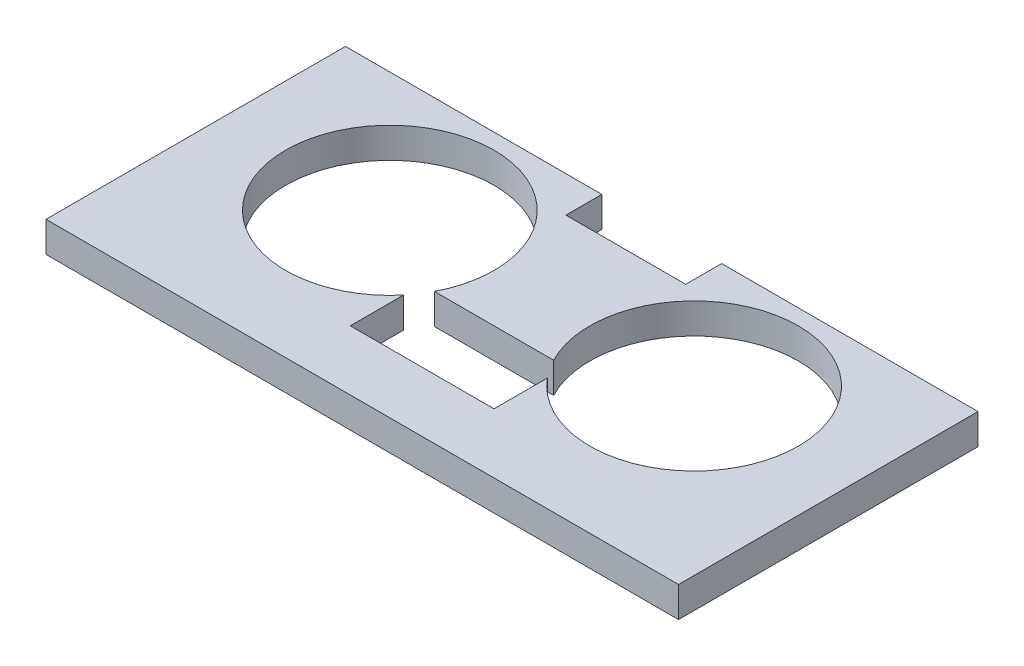
ISO-10303-21;
HEADER;
FILE_DESCRIPTION(('STEP AP214'),'2;1');
FILE_NAME('part.step','',(''),(''),'','','');
FILE_SCHEMA(('AUTOMOTIVE_DESIGN { 1 0 10303 214 1 1 1 1 }'));
ENDSEC;
DATA;
#1=APPLICATION_CONTEXT('core data for automotive mechanical design processes');
#2=APPLICATION_PROTOCOL_DEFINITION('international standard','automotive_design',2000,#1);
#3=PRODUCT_CONTEXT('',#1,'mechanical');
#4=PRODUCT('Part','Part','',(#3));
#5=PRODUCT_RELATED_PRODUCT_CATEGORY('part','',(#4));
#6=PRODUCT_DEFINITION_FORMATION('','',#4);
#7=PRODUCT_DEFINITION_CONTEXT('part definition',#1,'design');
#8=PRODUCT_DEFINITION('design','',#6,#7);
#9=PRODUCT_DEFINITION_SHAPE('','',#8);
#10=(LENGTH_UNIT() NAMED_UNIT(*) SI_UNIT(.MILLI.,.METRE.));
#11=(NAMED_UNIT(*) PLANE_ANGLE_UNIT() SI_UNIT($,.RADIAN.));
#12=(NAMED_UNIT(*) SI_UNIT($,.STERADIAN.) SOLID_ANGLE_UNIT());
#13=UNCERTAINTY_MEASURE_WITH_UNIT(LENGTH_MEASURE(1.E-05),#10,'distance_accuracy_value','');
#14=(GEOMETRIC_REPRESENTATION_CONTEXT(3) GLOBAL_UNCERTAINTY_ASSIGNED_CONTEXT((#13)) GLOBAL_UNIT_ASSIGNED_CONTEXT((#10,
#11,#12)) REPRESENTATION_CONTEXT('',''));
#15=CARTESIAN_POINT('',(0.,0.,0.));
#16=DIRECTION('',(0.,0.,1.));
#17=DIRECTION('',(1.,0.,0.));
#18=AXIS2_PLACEMENT_3D('',#15,#16,#17);
#19=CARTESIAN_POINT('',(-20.8,2.54,0.));
#20=DIRECTION('',(1.,0.,0.));
#21=DIRECTION('',(0.,0.,-1.));
#22=AXIS2_PLACEMENT_3D('',#19,#20,#21);
#23=PLANE('',#22);
#24=DIRECTION('',(0.,0.,1.));
#25=VECTOR('',#24,1.);
#26=CARTESIAN_POINT('',(-20.8,0.,0.));
#27=LINE('',#26,#25);
#28=CARTESIAN_POINT('',(-20.8,0.,-11.5));
#29=VERTEX_POINT('',#28);
#30=CARTESIAN_POINT('',(-20.8,0.,13.5));
#31=VERTEX_POINT('',#30);
#32=EDGE_CURVE('E209',#29,#31,#27,.T.);
#33=ORIENTED_EDGE('',*,*,#32,.T.);
#34=DIRECTION('',(0.,-1.,0.));
#35=VECTOR('',#34,1.);
#36=CARTESIAN_POINT('',(-20.8,2.54,13.5));
#37=LINE('',#36,#35);
#38=CARTESIAN_POINT('',(-20.8,2.54,13.5));
#39=VERTEX_POINT('',#38);
#40=EDGE_CURVE('E11',#39,#31,#37,.T.);
#41=ORIENTED_EDGE('',*,*,#40,.F.);
#42=DIRECTION('',(0.,0.,1.));
#43=VECTOR('',#42,1.);
#44=CARTESIAN_POINT('',(-20.8,2.54,0.));
#45=LINE('',#44,#43);
#46=CARTESIAN_POINT('',(-20.8,2.54,-11.5));
#47=VERTEX_POINT('',#46);
#48=EDGE_CURVE('E308',#47,#39,#45,.T.);
#49=ORIENTED_EDGE('',*,*,#48,.F.);
#50=DIRECTION('',(0.,-1.,0.));
#51=VECTOR('',#50,1.);
#52=CARTESIAN_POINT('',(-20.8,2.54,-11.5));
#53=LINE('',#52,#51);
#54=EDGE_CURVE('E61',#47,#29,#53,.T.);
#55=ORIENTED_EDGE('',*,*,#54,.T.);
#56=EDGE_LOOP('',(#33,#41,#49,#55));
#57=FACE_BOUND('',#56,.T.);
#58=ADVANCED_FACE('F41',(#57),#23,.F.);
#59=CARTESIAN_POINT('',(0.,2.54,13.5));
#60=DIRECTION('',(0.,0.,-1.));
#61=DIRECTION('',(-1.,0.,0.));
#62=AXIS2_PLACEMENT_3D('',#59,#60,#61);
#63=PLANE('',#62);
#64=DIRECTION('',(1.,0.,0.));
#65=VECTOR('',#64,1.);
#66=CARTESIAN_POINT('',(0.,0.,13.5));
#67=LINE('',#66,#65);
#68=CARTESIAN_POINT('',(32.,0.,13.5));
#69=VERTEX_POINT('',#68);
#70=EDGE_CURVE('E212',#31,#69,#67,.T.);
#71=ORIENTED_EDGE('',*,*,#70,.T.);
#72=DIRECTION('',(0.,-1.,0.));
#73=VECTOR('',#72,1.);
#74=CARTESIAN_POINT('',(32.,2.54,13.5));
#75=LINE('',#74,#73);
#76=CARTESIAN_POINT('',(32.,2.54,13.5));
#77=VERTEX_POINT('',#76);
#78=EDGE_CURVE('E52',#77,#69,#75,.T.);
#79=ORIENTED_EDGE('',*,*,#78,.F.);
#80=DIRECTION('',(1.,0.,0.));
#81=VECTOR('',#80,1.);
#82=CARTESIAN_POINT('',(0.,2.54,13.5));
#83=LINE('',#82,#81);
#84=EDGE_CURVE('E311',#39,#77,#83,.T.);
#85=ORIENTED_EDGE('',*,*,#84,.F.);
#86=ORIENTED_EDGE('',*,*,#40,.T.);
#87=EDGE_LOOP('',(#71,#79,#85,#86));
#88=FACE_BOUND('',#87,.T.);
#89=ADVANCED_FACE('F342',(#88),#63,.F.);
#90=CARTESIAN_POINT('',(32.,2.54,0.));
#91=DIRECTION('',(1.,0.,0.));
#92=DIRECTION('',(0.,0.,-1.));
#93=AXIS2_PLACEMENT_3D('',#90,#91,#92);
#94=PLANE('',#93);
#95=DIRECTION('',(0.,0.,1.));
#96=VECTOR('',#95,1.);
#97=CARTESIAN_POINT('',(32.,0.,0.));
#98=LINE('',#97,#96);
#99=CARTESIAN_POINT('',(32.,0.,-11.5));
#100=VERTEX_POINT('',#99);
#101=EDGE_CURVE('E216',#100,#69,#98,.T.);
#102=ORIENTED_EDGE('',*,*,#101,.F.);
#103=DIRECTION('',(0.,-1.,0.));
#104=VECTOR('',#103,1.);
#105=CARTESIAN_POINT('',(32.,2.54,-11.5));
#106=LINE('',#105,#104);
#107=CARTESIAN_POINT('',(32.,2.54,-11.5));
#108=VERTEX_POINT('',#107);
#109=EDGE_CURVE('E243',#108,#100,#106,.T.);
#110=ORIENTED_EDGE('',*,*,#109,.F.);
#111=DIRECTION('',(0.,0.,1.));
#112=VECTOR('',#111,1.);
#113=CARTESIAN_POINT('',(32.,2.54,0.));
#114=LINE('',#113,#112);
#115=EDGE_CURVE('E314',#108,#77,#114,.T.);
#116=ORIENTED_EDGE('',*,*,#115,.T.);
#117=ORIENTED_EDGE('',*,*,#78,.T.);
#118=EDGE_LOOP('',(#102,#110,#116,#117));
#119=FACE_BOUND('',#118,.T.);
#120=ADVANCED_FACE('F327',(#119),#94,.T.);
#121=CARTESIAN_POINT('',(0.,2.54,-11.5));
#122=DIRECTION('',(0.,0.,-1.));
#123=DIRECTION('',(-1.,0.,0.));
#124=AXIS2_PLACEMENT_3D('',#121,#122,#123);
#125=PLANE('',#124);
#126=DIRECTION('',(1.,0.,0.));
#127=VECTOR('',#126,1.);
#128=CARTESIAN_POINT('',(0.,0.,-11.5));
#129=LINE('',#128,#127);
#130=CARTESIAN_POINT('',(10.6,0.,-11.5));
#131=VERTEX_POINT('',#130);
#132=EDGE_CURVE('E220',#131,#100,#129,.T.);
#133=ORIENTED_EDGE('',*,*,#132,.F.);
#134=DIRECTION('',(0.,-1.,0.));
#135=VECTOR('',#134,1.);
#136=CARTESIAN_POINT('',(10.6,2.54,-11.5));
#137=LINE('',#136,#135);
#138=CARTESIAN_POINT('',(10.6,2.54,-11.5));
#139=VERTEX_POINT('',#138);
#140=EDGE_CURVE('E240',#139,#131,#137,.T.);
#141=ORIENTED_EDGE('',*,*,#140,.F.);
#142=DIRECTION('',(1.,0.,0.));
#143=VECTOR('',#142,1.);
#144=CARTESIAN_POINT('',(0.,2.54,-11.5));
#145=LINE('',#144,#143);
#146=EDGE_CURVE('E182',#139,#108,#145,.T.);
#147=ORIENTED_EDGE('',*,*,#146,.T.);
#148=ORIENTED_EDGE('',*,*,#109,.T.);
#149=EDGE_LOOP('',(#133,#141,#147,#148));
#150=FACE_BOUND('',#149,.T.);
#151=ADVANCED_FACE('F322',(#150),#125,.T.);
#152=CARTESIAN_POINT('',(10.6,2.54,0.));
#153=DIRECTION('',(1.,0.,0.));
#154=DIRECTION('',(0.,0.,-1.));
#155=AXIS2_PLACEMENT_3D('',#152,#153,#154);
#156=PLANE('',#155);
#157=DIRECTION('',(0.,0.,1.));
#158=VECTOR('',#157,1.);
#159=CARTESIAN_POINT('',(10.6,0.,0.));
#160=LINE('',#159,#158);
#161=CARTESIAN_POINT('',(10.6,0.,-8.5));
#162=VERTEX_POINT('',#161);
#163=EDGE_CURVE('E224',#131,#162,#160,.T.);
#164=ORIENTED_EDGE('',*,*,#163,.T.);
#165=DIRECTION('',(0.,-1.,0.));
#166=VECTOR('',#165,1.);
#167=CARTESIAN_POINT('',(10.6,2.54,-8.5));
#168=LINE('',#167,#166);
#169=CARTESIAN_POINT('',(10.6,2.54,-8.5));
#170=VERTEX_POINT('',#169);
#171=EDGE_CURVE('E161',#170,#162,#168,.T.);
#172=ORIENTED_EDGE('',*,*,#171,.F.);
#173=DIRECTION('',(0.,0.,1.));
#174=VECTOR('',#173,1.);
#175=CARTESIAN_POINT('',(10.6,2.54,0.));
#176=LINE('',#175,#174);
#177=EDGE_CURVE('E171',#139,#170,#176,.T.);
#178=ORIENTED_EDGE('',*,*,#177,.F.);
#179=ORIENTED_EDGE('',*,*,#140,.T.);
#180=EDGE_LOOP('',(#164,#172,#178,#179));
#181=FACE_BOUND('',#180,.T.);
#182=ADVANCED_FACE('F330',(#181),#156,.F.);
#183=CARTESIAN_POINT('',(0.,2.54,-8.5));
#184=DIRECTION('',(0.,0.,-1.));
#185=DIRECTION('',(-1.,0.,0.));
#186=AXIS2_PLACEMENT_3D('',#183,#184,#185);
#187=PLANE('',#186);
#188=DIRECTION('',(1.,0.,0.));
#189=VECTOR('',#188,1.);
#190=CARTESIAN_POINT('',(0.,0.,-8.5));
#191=LINE('',#190,#189);
#192=CARTESIAN_POINT('',(0.600000000000009,0.,-8.5));
#193=VERTEX_POINT('',#192);
#194=EDGE_CURVE('E156',#193,#162,#191,.T.);
#195=ORIENTED_EDGE('',*,*,#194,.F.);
#196=DIRECTION('',(0.,-1.,0.));
#197=VECTOR('',#196,1.);
#198=CARTESIAN_POINT('',(0.600000000000009,2.54,-8.5));
#199=LINE('',#198,#197);
#200=CARTESIAN_POINT('',(0.600000000000009,2.54,-8.5));
#201=VERTEX_POINT('',#200);
#202=EDGE_CURVE('E151',#201,#193,#199,.T.);
#203=ORIENTED_EDGE('',*,*,#202,.F.);
#204=DIRECTION('',(1.,0.,0.));
#205=VECTOR('',#204,1.);
#206=CARTESIAN_POINT('',(0.,2.54,-8.5));
#207=LINE('',#206,#205);
#208=EDGE_CURVE('E154',#201,#170,#207,.T.);
#209=ORIENTED_EDGE('',*,*,#208,.T.);
#210=ORIENTED_EDGE('',*,*,#171,.T.);
#211=EDGE_LOOP('',(#195,#203,#209,#210));
#212=FACE_BOUND('',#211,.T.);
#213=ADVANCED_FACE('F153',(#212),#187,.T.);
#214=CARTESIAN_POINT('',(0.60000000000001,2.54,0.));
#215=DIRECTION('',(1.,0.,0.));
#216=DIRECTION('',(0.,0.,-1.));
#217=AXIS2_PLACEMENT_3D('',#214,#215,#216);
#218=PLANE('',#217);
#219=DIRECTION('',(0.,0.,1.));
#220=VECTOR('',#219,1.);
#221=CARTESIAN_POINT('',(0.60000000000001,0.,0.));
#222=LINE('',#221,#220);
#223=CARTESIAN_POINT('',(0.600000000000009,0.,-11.5));
#224=VERTEX_POINT('',#223);
#225=EDGE_CURVE('E231',#224,#193,#222,.T.);
#226=ORIENTED_EDGE('',*,*,#225,.F.);
#227=DIRECTION('',(0.,-1.,0.));
#228=VECTOR('',#227,1.);
#229=CARTESIAN_POINT('',(0.600000000000009,2.54,-11.5));
#230=LINE('',#229,#228);
#231=CARTESIAN_POINT('',(0.600000000000009,2.54,-11.5));
#232=VERTEX_POINT('',#231);
#233=EDGE_CURVE('E105',#232,#224,#230,.T.);
#234=ORIENTED_EDGE('',*,*,#233,.F.);
#235=DIRECTION('',(0.,0.,1.));
#236=VECTOR('',#235,1.);
#237=CARTESIAN_POINT('',(0.60000000000001,2.54,0.));
#238=LINE('',#237,#236);
#239=EDGE_CURVE('E168',#232,#201,#238,.T.);
#240=ORIENTED_EDGE('',*,*,#239,.T.);
#241=ORIENTED_EDGE('',*,*,#202,.T.);
#242=EDGE_LOOP('',(#226,#234,#240,#241));
#243=FACE_BOUND('',#242,.T.);
#244=ADVANCED_FACE('F175',(#243),#218,.T.);
#245=CARTESIAN_POINT('',(0.,2.54,8.5));
#246=DIRECTION('',(0.,0.,-1.));
#247=DIRECTION('',(-1.,0.,0.));
#248=AXIS2_PLACEMENT_3D('',#245,#246,#247);
#249=PLANE('',#248);
#250=DIRECTION('',(1.,0.,0.));
#251=VECTOR('',#250,1.);
#252=CARTESIAN_POINT('',(0.,0.,8.5));
#253=LINE('',#252,#251);
#254=CARTESIAN_POINT('',(-0.399999999999987,0.,8.5));
#255=VERTEX_POINT('',#254);
#256=CARTESIAN_POINT('',(11.6,0.,8.5));
#257=VERTEX_POINT('',#256);
#258=EDGE_CURVE('E185',#255,#257,#253,.T.);
#259=ORIENTED_EDGE('',*,*,#258,.F.);
#260=DIRECTION('',(0.,-1.,0.));
#261=VECTOR('',#260,1.);
#262=CARTESIAN_POINT('',(-0.399999999999987,2.54,8.5));
#263=LINE('',#262,#261);
#264=CARTESIAN_POINT('',(-0.399999999999987,2.54,8.5));
#265=VERTEX_POINT('',#264);
#266=EDGE_CURVE('E45',#265,#255,#263,.T.);
#267=ORIENTED_EDGE('',*,*,#266,.F.);
#268=DIRECTION('',(1.,0.,0.));
#269=VECTOR('',#268,1.);
#270=CARTESIAN_POINT('',(0.,2.54,8.5));
#271=LINE('',#270,#269);
#272=CARTESIAN_POINT('',(11.6,2.54,8.5));
#273=VERTEX_POINT('',#272);
#274=EDGE_CURVE('E275',#265,#273,#271,.T.);
#275=ORIENTED_EDGE('',*,*,#274,.T.);
#276=DIRECTION('',(0.,-1.,0.));
#277=VECTOR('',#276,1.);
#278=CARTESIAN_POINT('',(11.6,2.54,8.5));
#279=LINE('',#278,#277);
#280=EDGE_CURVE('E180',#273,#257,#279,.T.);
#281=ORIENTED_EDGE('',*,*,#280,.T.);
#282=EDGE_LOOP('',(#259,#267,#275,#281));
#283=FACE_BOUND('',#282,.T.);
#284=ADVANCED_FACE('F43',(#283),#249,.T.);
#285=CARTESIAN_POINT('',(-0.399999999999987,2.54,0.));
#286=DIRECTION('',(-1.,0.,0.));
#287=DIRECTION('',(0.,0.,1.));
#288=AXIS2_PLACEMENT_3D('',#285,#286,#287);
#289=PLANE('',#288);
#290=DIRECTION('',(0.,0.,-1.));
#291=VECTOR('',#290,1.);
#292=CARTESIAN_POINT('',(-0.399999999999987,0.,0.));
#293=LINE('',#292,#291);
#294=CARTESIAN_POINT('',(-0.399999999999987,0.,4.04977477020464));
#295=VERTEX_POINT('',#294);
#296=EDGE_CURVE('E189',#255,#295,#293,.T.);
#297=ORIENTED_EDGE('',*,*,#296,.T.);
#298=DIRECTION('',(0.,-1.,0.));
#299=VECTOR('',#298,1.);
#300=CARTESIAN_POINT('',(-0.399999999999987,2.54,4.04977477020464));
#301=LINE('',#300,#299);
#302=CARTESIAN_POINT('',(-0.399999999999987,2.54,4.04977477020464));
#303=VERTEX_POINT('',#302);
#304=EDGE_CURVE('E258',#303,#295,#301,.T.);
#305=ORIENTED_EDGE('',*,*,#304,.F.);
#306=DIRECTION('',(0.,0.,-1.));
#307=VECTOR('',#306,1.);
#308=CARTESIAN_POINT('',(-0.399999999999987,2.54,0.));
#309=LINE('',#308,#307);
#310=EDGE_CURVE('E268',#265,#303,#309,.T.);
#311=ORIENTED_EDGE('',*,*,#310,.F.);
#312=ORIENTED_EDGE('',*,*,#266,.T.);
#313=EDGE_LOOP('',(#297,#305,#311,#312));
#314=FACE_BOUND('',#313,.T.);
#315=ADVANCED_FACE('F267',(#314),#289,.F.);
#316=CARTESIAN_POINT('',(-7.09999999999999,2.54,-1.5));
#317=DIRECTION('',(0.,-1.,0.));
#318=DIRECTION('',(0.,0.,-1.));
#319=AXIS2_PLACEMENT_3D('',#316,#317,#318);
#320=CYLINDRICAL_SURFACE('',#319,8.7);
#321=CARTESIAN_POINT('',(-7.09999999999999,0.,-1.5));
#322=DIRECTION('',(0.,1.,0.));
#323=DIRECTION('',(0.,0.,1.));
#324=AXIS2_PLACEMENT_3D('',#321,#322,#323);
#325=CIRCLE('',#324,8.7);
#326=CARTESIAN_POINT('',(0.625930364687489,0.,2.5));
#327=VERTEX_POINT('',#326);
#328=EDGE_CURVE('E193',#327,#295,#325,.T.);
#329=ORIENTED_EDGE('',*,*,#328,.F.);
#330=DIRECTION('',(0.,-1.,0.));
#331=VECTOR('',#330,1.);
#332=CARTESIAN_POINT('',(0.625930364687489,2.54,2.5));
#333=LINE('',#332,#331);
#334=CARTESIAN_POINT('',(0.625930364687489,2.54,2.5));
#335=VERTEX_POINT('',#334);
#336=EDGE_CURVE('E256',#335,#327,#333,.T.);
#337=ORIENTED_EDGE('',*,*,#336,.F.);
#338=CARTESIAN_POINT('',(-7.09999999999999,2.54,-1.5));
#339=DIRECTION('',(0.,1.,0.));
#340=DIRECTION('',(0.,0.,1.));
#341=AXIS2_PLACEMENT_3D('',#338,#339,#340);
#342=CIRCLE('',#341,8.7);
#343=EDGE_CURVE('E294',#335,#303,#342,.T.);
#344=ORIENTED_EDGE('',*,*,#343,.T.);
#345=ORIENTED_EDGE('',*,*,#304,.T.);
#346=EDGE_LOOP('',(#329,#337,#344,#345));
#347=FACE_BOUND('',#346,.T.);
#348=ADVANCED_FACE('F293',(#347),#320,.F.);
#349=CARTESIAN_POINT('',(0.,2.54,2.5));
#350=DIRECTION('',(0.,0.,-1.));
#351=DIRECTION('',(-1.,0.,0.));
#352=AXIS2_PLACEMENT_3D('',#349,#350,#351);
#353=PLANE('',#352);
#354=DIRECTION('',(1.,0.,0.));
#355=VECTOR('',#354,1.);
#356=CARTESIAN_POINT('',(0.,0.,2.5));
#357=LINE('',#356,#355);
#358=CARTESIAN_POINT('',(10.5740696353125,0.,2.5));
#359=VERTEX_POINT('',#358);
#360=EDGE_CURVE('E197',#327,#359,#357,.T.);
#361=ORIENTED_EDGE('',*,*,#360,.T.);
#362=DIRECTION('',(0.,-1.,0.));
#363=VECTOR('',#362,1.);
#364=CARTESIAN_POINT('',(10.5740696353125,2.54,2.5));
#365=LINE('',#364,#363);
#366=CARTESIAN_POINT('',(10.5740696353125,2.54,2.5));
#367=VERTEX_POINT('',#366);
#368=EDGE_CURVE('E253',#367,#359,#365,.T.);
#369=ORIENTED_EDGE('',*,*,#368,.F.);
#370=DIRECTION('',(1.,0.,0.));
#371=VECTOR('',#370,1.);
#372=CARTESIAN_POINT('',(0.,2.54,2.5));
#373=LINE('',#372,#371);
#374=EDGE_CURVE('E291',#335,#367,#373,.T.);
#375=ORIENTED_EDGE('',*,*,#374,.F.);
#376=ORIENTED_EDGE('',*,*,#336,.T.);
#377=EDGE_LOOP('',(#361,#369,#375,#376));
#378=FACE_BOUND('',#377,.T.);
#379=ADVANCED_FACE('F290',(#378),#353,.F.);
#380=CARTESIAN_POINT('',(18.3,2.54,-1.5));
#381=DIRECTION('',(0.,-1.,0.));
#382=DIRECTION('',(0.,0.,-1.));
#383=AXIS2_PLACEMENT_3D('',#380,#381,#382);
#384=CYLINDRICAL_SURFACE('',#383,8.7);
#385=CARTESIAN_POINT('',(18.3,0.,-1.5));
#386=DIRECTION('',(0.,1.,0.));
#387=DIRECTION('',(0.,0.,1.));
#388=AXIS2_PLACEMENT_3D('',#385,#386,#387);
#389=CIRCLE('',#388,8.7);
#390=CARTESIAN_POINT('',(11.6,0.,4.04977477020464));
#391=VERTEX_POINT('',#390);
#392=EDGE_CURVE('E201',#391,#359,#389,.T.);
#393=ORIENTED_EDGE('',*,*,#392,.F.);
#394=DIRECTION('',(0.,-1.,0.));
#395=VECTOR('',#394,1.);
#396=CARTESIAN_POINT('',(11.6,2.54,4.04977477020464));
#397=LINE('',#396,#395);
#398=CARTESIAN_POINT('',(11.6,2.54,4.04977477020464));
#399=VERTEX_POINT('',#398);
#400=EDGE_CURVE('E250',#399,#391,#397,.T.);
#401=ORIENTED_EDGE('',*,*,#400,.F.);
#402=CARTESIAN_POINT('',(18.3,2.54,-1.5));
#403=DIRECTION('',(0.,1.,0.));
#404=DIRECTION('',(0.,0.,1.));
#405=AXIS2_PLACEMENT_3D('',#402,#403,#404);
#406=CIRCLE('',#405,8.7);
#407=EDGE_CURVE('E287',#399,#367,#406,.T.);
#408=ORIENTED_EDGE('',*,*,#407,.T.);
#409=ORIENTED_EDGE('',*,*,#368,.T.);
#410=EDGE_LOOP('',(#393,#401,#408,#409));
#411=FACE_BOUND('',#410,.T.);
#412=ADVANCED_FACE('F283',(#411),#384,.F.);
#413=CARTESIAN_POINT('',(11.6,2.54,0.));
#414=DIRECTION('',(-1.,0.,0.));
#415=DIRECTION('',(0.,0.,1.));
#416=AXIS2_PLACEMENT_3D('',#413,#414,#415);
#417=PLANE('',#416);
#418=DIRECTION('',(0.,0.,-1.));
#419=VECTOR('',#418,1.);
#420=CARTESIAN_POINT('',(11.6,0.,0.));
#421=LINE('',#420,#419);
#422=EDGE_CURVE('E205',#257,#391,#421,.T.);
#423=ORIENTED_EDGE('',*,*,#422,.F.);
#424=ORIENTED_EDGE('',*,*,#280,.F.);
#425=DIRECTION('',(0.,0.,-1.));
#426=VECTOR('',#425,1.);
#427=CARTESIAN_POINT('',(11.6,2.54,0.));
#428=LINE('',#427,#426);
#429=EDGE_CURVE('E280',#273,#399,#428,.T.);
#430=ORIENTED_EDGE('',*,*,#429,.T.);
#431=ORIENTED_EDGE('',*,*,#400,.T.);
#432=EDGE_LOOP('',(#423,#424,#430,#431));
#433=FACE_BOUND('',#432,.T.);
#434=ADVANCED_FACE('F279',(#433),#417,.T.);
#435=EDGE_CURVE('E225',#29,#224,#129,.T.);
#436=ORIENTED_EDGE('',*,*,#435,.F.);
#437=ORIENTED_EDGE('',*,*,#54,.F.);
#438=EDGE_CURVE('E177',#47,#232,#145,.T.);
#439=ORIENTED_EDGE('',*,*,#438,.T.);
#440=ORIENTED_EDGE('',*,*,#233,.T.);
#441=EDGE_LOOP('',(#436,#437,#439,#440));
#442=FACE_BOUND('',#441,.T.);
#443=ADVANCED_FACE('F339',(#442),#125,.T.);
#444=CARTESIAN_POINT('',(0.,2.54,0.));
#445=DIRECTION('',(0.,1.,0.));
#446=DIRECTION('',(0.,0.,1.));
#447=AXIS2_PLACEMENT_3D('',#444,#445,#446);
#448=PLANE('',#447);
#449=ORIENTED_EDGE('',*,*,#274,.F.);
#450=ORIENTED_EDGE('',*,*,#310,.T.);
#451=ORIENTED_EDGE('',*,*,#343,.F.);
#452=ORIENTED_EDGE('',*,*,#374,.T.);
#453=ORIENTED_EDGE('',*,*,#407,.F.);
#454=ORIENTED_EDGE('',*,*,#429,.F.);
#455=EDGE_LOOP('',(#449,#450,#451,#452,#453,#454));
#456=FACE_BOUND('',#455,.T.);
#457=ORIENTED_EDGE('',*,*,#48,.T.);
#458=ORIENTED_EDGE('',*,*,#84,.T.);
#459=ORIENTED_EDGE('',*,*,#115,.F.);
#460=ORIENTED_EDGE('',*,*,#146,.F.);
#461=ORIENTED_EDGE('',*,*,#177,.T.);
#462=ORIENTED_EDGE('',*,*,#208,.F.);
#463=ORIENTED_EDGE('',*,*,#239,.F.);
#464=ORIENTED_EDGE('',*,*,#438,.F.);
#465=EDGE_LOOP('',(#457,#458,#459,#460,#461,#462,#463,#464));
#466=FACE_BOUND('',#465,.T.);
#467=ADVANCED_FACE('F166',(#456,#466),#448,.T.);
#468=CARTESIAN_POINT('',(0.,0.,0.));
#469=DIRECTION('',(0.,1.,0.));
#470=DIRECTION('',(0.,0.,1.));
#471=AXIS2_PLACEMENT_3D('',#468,#469,#470);
#472=PLANE('',#471);
#473=ORIENTED_EDGE('',*,*,#258,.T.);
#474=ORIENTED_EDGE('',*,*,#422,.T.);
#475=ORIENTED_EDGE('',*,*,#392,.T.);
#476=ORIENTED_EDGE('',*,*,#360,.F.);
#477=ORIENTED_EDGE('',*,*,#328,.T.);
#478=ORIENTED_EDGE('',*,*,#296,.F.);
#479=EDGE_LOOP('',(#473,#474,#475,#476,#477,#478));
#480=FACE_BOUND('',#479,.T.);
#481=ORIENTED_EDGE('',*,*,#32,.F.);
#482=ORIENTED_EDGE('',*,*,#435,.T.);
#483=ORIENTED_EDGE('',*,*,#225,.T.);
#484=ORIENTED_EDGE('',*,*,#194,.T.);
#485=ORIENTED_EDGE('',*,*,#163,.F.);
#486=ORIENTED_EDGE('',*,*,#132,.T.);
#487=ORIENTED_EDGE('',*,*,#101,.T.);
#488=ORIENTED_EDGE('',*,*,#70,.F.);
#489=EDGE_LOOP('',(#481,#482,#483,#484,#485,#486,#487,#488));
#490=FACE_BOUND('',#489,.T.);
#491=ADVANCED_FACE('F271',(#480,#490),#472,.F.);
#492=CLOSED_SHELL('',(#58,#89,#120,#151,#182,#213,#244,#284,#315,#348,#379,#412,#434,#443,#467,#491));
#493=MANIFOLD_SOLID_BREP('B2',#492);
#494=ADVANCED_BREP_SHAPE_REPRESENTATION('',(#18,#493),#14);
#495=SHAPE_DEFINITION_REPRESENTATION(#9,#494);
ENDSEC;
END-ISO-10303-21;
